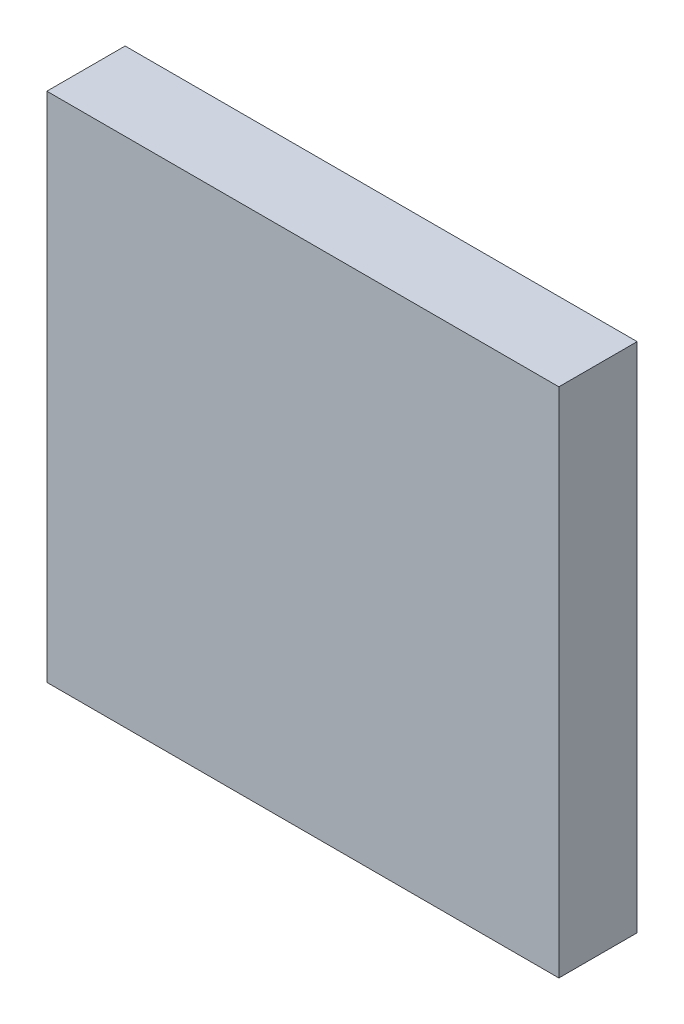
ISO-10303-21;
HEADER;
FILE_DESCRIPTION(('STEP AP214'),'2;1');
FILE_NAME('part.step','',(''),(''),'','','');
FILE_SCHEMA(('AUTOMOTIVE_DESIGN { 1 0 10303 214 1 1 1 1 }'));
ENDSEC;
DATA;
#1=APPLICATION_CONTEXT('core data for automotive mechanical design processes');
#2=APPLICATION_PROTOCOL_DEFINITION('international standard','automotive_design',2000,#1);
#3=PRODUCT_CONTEXT('',#1,'mechanical');
#4=PRODUCT('Part','Part','',(#3));
#5=PRODUCT_RELATED_PRODUCT_CATEGORY('part','',(#4));
#6=PRODUCT_DEFINITION_FORMATION('','',#4);
#7=PRODUCT_DEFINITION_CONTEXT('part definition',#1,'design');
#8=PRODUCT_DEFINITION('design','',#6,#7);
#9=PRODUCT_DEFINITION_SHAPE('','',#8);
#10=(LENGTH_UNIT() NAMED_UNIT(*) SI_UNIT(.MILLI.,.METRE.));
#11=(NAMED_UNIT(*) PLANE_ANGLE_UNIT() SI_UNIT($,.RADIAN.));
#12=(NAMED_UNIT(*) SI_UNIT($,.STERADIAN.) SOLID_ANGLE_UNIT());
#13=UNCERTAINTY_MEASURE_WITH_UNIT(LENGTH_MEASURE(1.E-05),#10,'distance_accuracy_value','');
#14=(GEOMETRIC_REPRESENTATION_CONTEXT(3) GLOBAL_UNCERTAINTY_ASSIGNED_CONTEXT((#13)) GLOBAL_UNIT_ASSIGNED_CONTEXT((#10,
#11,#12)) REPRESENTATION_CONTEXT('',''));
#15=CARTESIAN_POINT('',(0.,0.,0.));
#16=DIRECTION('',(0.,0.,1.));
#17=DIRECTION('',(1.,0.,0.));
#18=AXIS2_PLACEMENT_3D('',#15,#16,#17);
#19=CARTESIAN_POINT('',(35.,35.,-10.7));
#20=DIRECTION('',(1.,0.,0.));
#21=DIRECTION('',(0.,1.,0.));
#22=AXIS2_PLACEMENT_3D('',#19,#20,#21);
#23=PLANE('',#22);
#24=DIRECTION('',(0.,1.,0.));
#25=VECTOR('',#24,1.);
#26=CARTESIAN_POINT('',(35.,35.,0.));
#27=LINE('',#26,#25);
#28=CARTESIAN_POINT('',(35.,-35.,0.));
#29=VERTEX_POINT('',#28);
#30=CARTESIAN_POINT('',(35.,35.,0.));
#31=VERTEX_POINT('',#30);
#32=EDGE_CURVE('E142',#29,#31,#27,.T.);
#33=ORIENTED_EDGE('',*,*,#32,.F.);
#34=DIRECTION('',(0.,0.,1.));
#35=VECTOR('',#34,1.);
#36=CARTESIAN_POINT('',(35.,-35.,-10.7));
#37=LINE('',#36,#35);
#38=CARTESIAN_POINT('',(35.,-35.,-10.7));
#39=VERTEX_POINT('',#38);
#40=EDGE_CURVE('E11',#39,#29,#37,.T.);
#41=ORIENTED_EDGE('',*,*,#40,.F.);
#42=DIRECTION('',(0.,1.,0.));
#43=VECTOR('',#42,1.);
#44=CARTESIAN_POINT('',(35.,35.,-10.7));
#45=LINE('',#44,#43);
#46=CARTESIAN_POINT('',(35.,35.,-10.7));
#47=VERTEX_POINT('',#46);
#48=EDGE_CURVE('E146',#39,#47,#45,.T.);
#49=ORIENTED_EDGE('',*,*,#48,.T.);
#50=DIRECTION('',(0.,0.,1.));
#51=VECTOR('',#50,1.);
#52=CARTESIAN_POINT('',(35.,35.,-10.7));
#53=LINE('',#52,#51);
#54=EDGE_CURVE('E38',#47,#31,#53,.T.);
#55=ORIENTED_EDGE('',*,*,#54,.T.);
#56=EDGE_LOOP('',(#33,#41,#49,#55));
#57=FACE_BOUND('',#56,.T.);
#58=ADVANCED_FACE('F35',(#57),#23,.T.);
#59=CARTESIAN_POINT('',(-35.,-35.,-10.7));
#60=DIRECTION('',(0.,-1.,0.));
#61=DIRECTION('',(0.,0.,-1.));
#62=AXIS2_PLACEMENT_3D('',#59,#60,#61);
#63=PLANE('',#62);
#64=DIRECTION('',(1.,0.,0.));
#65=VECTOR('',#64,1.);
#66=CARTESIAN_POINT('',(-35.,-35.,0.));
#67=LINE('',#66,#65);
#68=CARTESIAN_POINT('',(-35.,-35.,0.));
#69=VERTEX_POINT('',#68);
#70=EDGE_CURVE('E149',#69,#29,#67,.T.);
#71=ORIENTED_EDGE('',*,*,#70,.F.);
#72=DIRECTION('',(0.,0.,1.));
#73=VECTOR('',#72,1.);
#74=CARTESIAN_POINT('',(-35.,-35.,-10.7));
#75=LINE('',#74,#73);
#76=CARTESIAN_POINT('',(-35.,-35.,-10.7));
#77=VERTEX_POINT('',#76);
#78=EDGE_CURVE('E43',#77,#69,#75,.T.);
#79=ORIENTED_EDGE('',*,*,#78,.F.);
#80=DIRECTION('',(1.,0.,0.));
#81=VECTOR('',#80,1.);
#82=CARTESIAN_POINT('',(-35.,-35.,-10.7));
#83=LINE('',#82,#81);
#84=EDGE_CURVE('E154',#77,#39,#83,.T.);
#85=ORIENTED_EDGE('',*,*,#84,.T.);
#86=ORIENTED_EDGE('',*,*,#40,.T.);
#87=EDGE_LOOP('',(#71,#79,#85,#86));
#88=FACE_BOUND('',#87,.T.);
#89=ADVANCED_FACE('F171',(#88),#63,.T.);
#90=CARTESIAN_POINT('',(-35.,35.,-10.7));
#91=DIRECTION('',(-1.,0.,0.));
#92=DIRECTION('',(0.,-1.,0.));
#93=AXIS2_PLACEMENT_3D('',#90,#91,#92);
#94=PLANE('',#93);
#95=DIRECTION('',(0.,-1.,0.));
#96=VECTOR('',#95,1.);
#97=CARTESIAN_POINT('',(-35.,35.,0.));
#98=LINE('',#97,#96);
#99=CARTESIAN_POINT('',(-35.,35.,0.));
#100=VERTEX_POINT('',#99);
#101=EDGE_CURVE('E161',#100,#69,#98,.T.);
#102=ORIENTED_EDGE('',*,*,#101,.F.);
#103=DIRECTION('',(0.,0.,1.));
#104=VECTOR('',#103,1.);
#105=CARTESIAN_POINT('',(-35.,35.,-10.7));
#106=LINE('',#105,#104);
#107=CARTESIAN_POINT('',(-35.,35.,-10.7));
#108=VERTEX_POINT('',#107);
#109=EDGE_CURVE('E166',#108,#100,#106,.T.);
#110=ORIENTED_EDGE('',*,*,#109,.F.);
#111=DIRECTION('',(0.,-1.,0.));
#112=VECTOR('',#111,1.);
#113=CARTESIAN_POINT('',(-35.,35.,-10.7));
#114=LINE('',#113,#112);
#115=EDGE_CURVE('E151',#108,#77,#114,.T.);
#116=ORIENTED_EDGE('',*,*,#115,.T.);
#117=ORIENTED_EDGE('',*,*,#78,.T.);
#118=EDGE_LOOP('',(#102,#110,#116,#117));
#119=FACE_BOUND('',#118,.T.);
#120=ADVANCED_FACE('F175',(#119),#94,.T.);
#121=CARTESIAN_POINT('',(-35.,35.,-10.7));
#122=DIRECTION('',(0.,1.,0.));
#123=DIRECTION('',(0.,0.,1.));
#124=AXIS2_PLACEMENT_3D('',#121,#122,#123);
#125=PLANE('',#124);
#126=DIRECTION('',(-1.,0.,0.));
#127=VECTOR('',#126,1.);
#128=CARTESIAN_POINT('',(-35.,35.,0.));
#129=LINE('',#128,#127);
#130=EDGE_CURVE('E158',#31,#100,#129,.T.);
#131=ORIENTED_EDGE('',*,*,#130,.F.);
#132=ORIENTED_EDGE('',*,*,#54,.F.);
#133=DIRECTION('',(-1.,0.,0.));
#134=VECTOR('',#133,1.);
#135=CARTESIAN_POINT('',(-35.,35.,-10.7));
#136=LINE('',#135,#134);
#137=EDGE_CURVE('E148',#47,#108,#136,.T.);
#138=ORIENTED_EDGE('',*,*,#137,.T.);
#139=ORIENTED_EDGE('',*,*,#109,.T.);
#140=EDGE_LOOP('',(#131,#132,#138,#139));
#141=FACE_BOUND('',#140,.T.);
#142=ADVANCED_FACE('F168',(#141),#125,.T.);
#143=CARTESIAN_POINT('',(0.,0.,-10.7));
#144=DIRECTION('',(0.,0.,1.));
#145=DIRECTION('',(1.,0.,0.));
#146=AXIS2_PLACEMENT_3D('',#143,#144,#145);
#147=PLANE('',#146);
#148=DIRECTION('',(1.,0.,0.));
#149=VECTOR('',#148,1.);
#150=CARTESIAN_POINT('',(30.25,30.25,-10.7));
#151=LINE('',#150,#149);
#152=CARTESIAN_POINT('',(-30.25,30.25,-10.7));
#153=VERTEX_POINT('',#152);
#154=CARTESIAN_POINT('',(30.25,30.25,-10.7));
#155=VERTEX_POINT('',#154);
#156=EDGE_CURVE('E136',#153,#155,#151,.T.);
#157=ORIENTED_EDGE('',*,*,#156,.F.);
#158=DIRECTION('',(0.,1.,0.));
#159=VECTOR('',#158,1.);
#160=CARTESIAN_POINT('',(-30.25,30.25,-10.7));
#161=LINE('',#160,#159);
#162=CARTESIAN_POINT('',(-30.25,-30.25,-10.7));
#163=VERTEX_POINT('',#162);
#164=EDGE_CURVE('E51',#163,#153,#161,.T.);
#165=ORIENTED_EDGE('',*,*,#164,.F.);
#166=DIRECTION('',(-1.,0.,0.));
#167=VECTOR('',#166,1.);
#168=CARTESIAN_POINT('',(30.25,-30.25,-10.7));
#169=LINE('',#168,#167);
#170=CARTESIAN_POINT('',(30.25,-30.25,-10.7));
#171=VERTEX_POINT('',#170);
#172=EDGE_CURVE('E127',#171,#163,#169,.T.);
#173=ORIENTED_EDGE('',*,*,#172,.F.);
#174=DIRECTION('',(0.,-1.,0.));
#175=VECTOR('',#174,1.);
#176=CARTESIAN_POINT('',(30.25,30.25,-10.7));
#177=LINE('',#176,#175);
#178=EDGE_CURVE('E130',#155,#171,#177,.T.);
#179=ORIENTED_EDGE('',*,*,#178,.F.);
#180=EDGE_LOOP('',(#157,#165,#173,#179));
#181=FACE_BOUND('',#180,.T.);
#182=ORIENTED_EDGE('',*,*,#48,.F.);
#183=ORIENTED_EDGE('',*,*,#84,.F.);
#184=ORIENTED_EDGE('',*,*,#115,.F.);
#185=ORIENTED_EDGE('',*,*,#137,.F.);
#186=EDGE_LOOP('',(#182,#183,#184,#185));
#187=FACE_BOUND('',#186,.T.);
#188=ADVANCED_FACE('F177',(#181,#187),#147,.F.);
#189=CARTESIAN_POINT('',(0.,0.,0.));
#190=DIRECTION('',(0.,0.,1.));
#191=DIRECTION('',(1.,0.,0.));
#192=AXIS2_PLACEMENT_3D('',#189,#190,#191);
#193=PLANE('',#192);
#194=ORIENTED_EDGE('',*,*,#32,.T.);
#195=ORIENTED_EDGE('',*,*,#130,.T.);
#196=ORIENTED_EDGE('',*,*,#101,.T.);
#197=ORIENTED_EDGE('',*,*,#70,.T.);
#198=EDGE_LOOP('',(#194,#195,#196,#197));
#199=FACE_BOUND('',#198,.T.);
#200=ADVANCED_FACE('F170',(#199),#193,.T.);
#201=CARTESIAN_POINT('',(-30.25,30.25,-1.5));
#202=DIRECTION('',(-1.,0.,0.));
#203=DIRECTION('',(0.,-1.,0.));
#204=AXIS2_PLACEMENT_3D('',#201,#202,#203);
#205=PLANE('',#204);
#206=ORIENTED_EDGE('',*,*,#164,.T.);
#207=DIRECTION('',(0.,0.,-1.));
#208=VECTOR('',#207,1.);
#209=CARTESIAN_POINT('',(-30.25,30.25,-1.5));
#210=LINE('',#209,#208);
#211=CARTESIAN_POINT('',(-30.25,30.25,-1.5));
#212=VERTEX_POINT('',#211);
#213=EDGE_CURVE('E105',#212,#153,#210,.T.);
#214=ORIENTED_EDGE('',*,*,#213,.F.);
#215=DIRECTION('',(0.,1.,0.));
#216=VECTOR('',#215,1.);
#217=CARTESIAN_POINT('',(-30.25,30.25,-1.5));
#218=LINE('',#217,#216);
#219=CARTESIAN_POINT('',(-30.25,-30.25,-1.5));
#220=VERTEX_POINT('',#219);
#221=EDGE_CURVE('E109',#220,#212,#218,.T.);
#222=ORIENTED_EDGE('',*,*,#221,.F.);
#223=DIRECTION('',(0.,0.,-1.));
#224=VECTOR('',#223,1.);
#225=CARTESIAN_POINT('',(-30.25,-30.25,-1.5));
#226=LINE('',#225,#224);
#227=EDGE_CURVE('E140',#220,#163,#226,.T.);
#228=ORIENTED_EDGE('',*,*,#227,.T.);
#229=EDGE_LOOP('',(#206,#214,#222,#228));
#230=FACE_BOUND('',#229,.T.);
#231=ADVANCED_FACE('F107',(#230),#205,.F.);
#232=CARTESIAN_POINT('',(30.25,-30.25,-1.5));
#233=DIRECTION('',(0.,-1.,0.));
#234=DIRECTION('',(0.,0.,-1.));
#235=AXIS2_PLACEMENT_3D('',#232,#233,#234);
#236=PLANE('',#235);
#237=ORIENTED_EDGE('',*,*,#172,.T.);
#238=ORIENTED_EDGE('',*,*,#227,.F.);
#239=DIRECTION('',(-1.,0.,0.));
#240=VECTOR('',#239,1.);
#241=CARTESIAN_POINT('',(30.25,-30.25,-1.5));
#242=LINE('',#241,#240);
#243=CARTESIAN_POINT('',(30.25,-30.25,-1.5));
#244=VERTEX_POINT('',#243);
#245=EDGE_CURVE('E115',#244,#220,#242,.T.);
#246=ORIENTED_EDGE('',*,*,#245,.F.);
#247=DIRECTION('',(0.,0.,-1.));
#248=VECTOR('',#247,1.);
#249=CARTESIAN_POINT('',(30.25,-30.25,-1.5));
#250=LINE('',#249,#248);
#251=EDGE_CURVE('E143',#244,#171,#250,.T.);
#252=ORIENTED_EDGE('',*,*,#251,.T.);
#253=EDGE_LOOP('',(#237,#238,#246,#252));
#254=FACE_BOUND('',#253,.T.);
#255=ADVANCED_FACE('F221',(#254),#236,.F.);
#256=CARTESIAN_POINT('',(30.25,30.25,-1.5));
#257=DIRECTION('',(1.,0.,0.));
#258=DIRECTION('',(0.,1.,0.));
#259=AXIS2_PLACEMENT_3D('',#256,#257,#258);
#260=PLANE('',#259);
#261=ORIENTED_EDGE('',*,*,#178,.T.);
#262=ORIENTED_EDGE('',*,*,#251,.F.);
#263=DIRECTION('',(0.,-1.,0.));
#264=VECTOR('',#263,1.);
#265=CARTESIAN_POINT('',(30.25,30.25,-1.5));
#266=LINE('',#265,#264);
#267=CARTESIAN_POINT('',(30.25,30.25,-1.5));
#268=VERTEX_POINT('',#267);
#269=EDGE_CURVE('E123',#268,#244,#266,.T.);
#270=ORIENTED_EDGE('',*,*,#269,.F.);
#271=DIRECTION('',(0.,0.,-1.));
#272=VECTOR('',#271,1.);
#273=CARTESIAN_POINT('',(30.25,30.25,-1.5));
#274=LINE('',#273,#272);
#275=EDGE_CURVE('E114',#268,#155,#274,.T.);
#276=ORIENTED_EDGE('',*,*,#275,.T.);
#277=EDGE_LOOP('',(#261,#262,#270,#276));
#278=FACE_BOUND('',#277,.T.);
#279=ADVANCED_FACE('F229',(#278),#260,.F.);
#280=CARTESIAN_POINT('',(30.25,30.25,-1.5));
#281=DIRECTION('',(0.,1.,0.));
#282=DIRECTION('',(0.,0.,1.));
#283=AXIS2_PLACEMENT_3D('',#280,#281,#282);
#284=PLANE('',#283);
#285=ORIENTED_EDGE('',*,*,#156,.T.);
#286=ORIENTED_EDGE('',*,*,#275,.F.);
#287=DIRECTION('',(1.,0.,0.));
#288=VECTOR('',#287,1.);
#289=CARTESIAN_POINT('',(30.25,30.25,-1.5));
#290=LINE('',#289,#288);
#291=EDGE_CURVE('E118',#212,#268,#290,.T.);
#292=ORIENTED_EDGE('',*,*,#291,.F.);
#293=ORIENTED_EDGE('',*,*,#213,.T.);
#294=EDGE_LOOP('',(#285,#286,#292,#293));
#295=FACE_BOUND('',#294,.T.);
#296=ADVANCED_FACE('F119',(#295),#284,.F.);
#297=CARTESIAN_POINT('',(0.,0.,-1.5));
#298=DIRECTION('',(0.,0.,-1.));
#299=DIRECTION('',(-1.,0.,0.));
#300=AXIS2_PLACEMENT_3D('',#297,#298,#299);
#301=PLANE('',#300);
#302=ORIENTED_EDGE('',*,*,#221,.T.);
#303=ORIENTED_EDGE('',*,*,#291,.T.);
#304=ORIENTED_EDGE('',*,*,#269,.T.);
#305=ORIENTED_EDGE('',*,*,#245,.T.);
#306=EDGE_LOOP('',(#302,#303,#304,#305));
#307=FACE_BOUND('',#306,.T.);
#308=ADVANCED_FACE('F125',(#307),#301,.T.);
#309=CLOSED_SHELL('',(#58,#89,#120,#142,#188,#200,#231,#255,#279,#296,#308));
#310=MANIFOLD_SOLID_BREP('B2',#309);
#311=ADVANCED_BREP_SHAPE_REPRESENTATION('',(#18,#310),#14);
#312=SHAPE_DEFINITION_REPRESENTATION(#9,#311);
ENDSEC;
END-ISO-10303-21;
